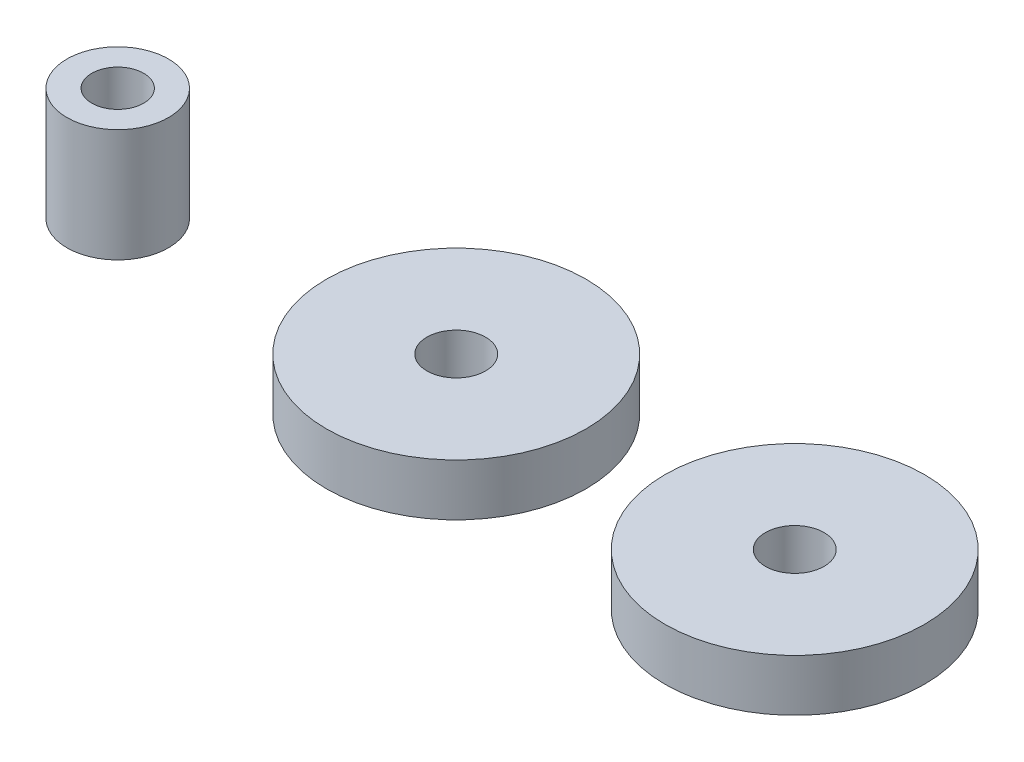
ISO-10303-21;
HEADER;
FILE_DESCRIPTION(('STEP AP214'),'2;1');
FILE_NAME('part.step','',(''),(''),'','','');
FILE_SCHEMA(('AUTOMOTIVE_DESIGN { 1 0 10303 214 1 1 1 1 }'));
ENDSEC;
DATA;
#1=APPLICATION_CONTEXT('core data for automotive mechanical design processes');
#2=APPLICATION_PROTOCOL_DEFINITION('international standard','automotive_design',2000,#1);
#3=PRODUCT_CONTEXT('',#1,'mechanical');
#4=PRODUCT('Part','Part','',(#3));
#5=PRODUCT_RELATED_PRODUCT_CATEGORY('part','',(#4));
#6=PRODUCT_DEFINITION_FORMATION('','',#4);
#7=PRODUCT_DEFINITION_CONTEXT('part definition',#1,'design');
#8=PRODUCT_DEFINITION('design','',#6,#7);
#9=PRODUCT_DEFINITION_SHAPE('','',#8);
#10=(LENGTH_UNIT() NAMED_UNIT(*) SI_UNIT(.MILLI.,.METRE.));
#11=(NAMED_UNIT(*) PLANE_ANGLE_UNIT() SI_UNIT($,.RADIAN.));
#12=(NAMED_UNIT(*) SI_UNIT($,.STERADIAN.) SOLID_ANGLE_UNIT());
#13=UNCERTAINTY_MEASURE_WITH_UNIT(LENGTH_MEASURE(1.E-05),#10,'distance_accuracy_value','');
#14=(GEOMETRIC_REPRESENTATION_CONTEXT(3) GLOBAL_UNCERTAINTY_ASSIGNED_CONTEXT((#13)) GLOBAL_UNIT_ASSIGNED_CONTEXT((#10,
#11,#12)) REPRESENTATION_CONTEXT('',''));
#15=CARTESIAN_POINT('',(0.,0.,0.));
#16=DIRECTION('',(0.,0.,1.));
#17=DIRECTION('',(1.,0.,0.));
#18=AXIS2_PLACEMENT_3D('',#15,#16,#17);
#19=CARTESIAN_POINT('',(30.,2.3,0.));
#20=DIRECTION('',(0.,1.,0.));
#21=DIRECTION('',(0.,0.,1.));
#22=AXIS2_PLACEMENT_3D('',#19,#20,#21);
#23=PLANE('',#22);
#24=CARTESIAN_POINT('',(30.,2.3,0.));
#25=DIRECTION('',(0.,1.,0.));
#26=DIRECTION('',(0.,0.,1.));
#27=AXIS2_PLACEMENT_3D('',#24,#25,#26);
#28=CIRCLE('',#27,5.75);
#29=CARTESIAN_POINT('',(30.,2.3,5.75));
#30=VERTEX_POINT('',#29);
#31=EDGE_CURVE('E11',#30,#30,#28,.T.);
#32=ORIENTED_EDGE('',*,*,#31,.T.);
#33=EDGE_LOOP('',(#32));
#34=FACE_BOUND('',#33,.T.);
#35=CARTESIAN_POINT('',(30.,2.3,0.));
#36=DIRECTION('',(0.,1.,0.));
#37=DIRECTION('',(0.,0.,1.));
#38=AXIS2_PLACEMENT_3D('',#35,#36,#37);
#39=CIRCLE('',#38,1.29999999999999);
#40=CARTESIAN_POINT('',(30.,2.3,1.29999999999999));
#41=VERTEX_POINT('',#40);
#42=EDGE_CURVE('E55',#41,#41,#39,.T.);
#43=ORIENTED_EDGE('',*,*,#42,.F.);
#44=EDGE_LOOP('',(#43));
#45=FACE_BOUND('',#44,.T.);
#46=ADVANCED_FACE('F44',(#34,#45),#23,.T.);
#47=CARTESIAN_POINT('',(30.,0.,0.));
#48=DIRECTION('',(0.,1.,0.));
#49=DIRECTION('',(0.,0.,1.));
#50=AXIS2_PLACEMENT_3D('',#47,#48,#49);
#51=PLANE('',#50);
#52=CARTESIAN_POINT('',(30.,0.,0.));
#53=DIRECTION('',(0.,1.,0.));
#54=DIRECTION('',(0.,0.,1.));
#55=AXIS2_PLACEMENT_3D('',#52,#53,#54);
#56=CIRCLE('',#55,5.75);
#57=CARTESIAN_POINT('',(30.,0.,5.75));
#58=VERTEX_POINT('',#57);
#59=EDGE_CURVE('E48',#58,#58,#56,.T.);
#60=ORIENTED_EDGE('',*,*,#59,.F.);
#61=EDGE_LOOP('',(#60));
#62=FACE_BOUND('',#61,.T.);
#63=CARTESIAN_POINT('',(30.,0.,0.));
#64=DIRECTION('',(0.,1.,0.));
#65=DIRECTION('',(0.,0.,1.));
#66=AXIS2_PLACEMENT_3D('',#63,#64,#65);
#67=CIRCLE('',#66,1.29999999999999);
#68=CARTESIAN_POINT('',(30.,0.,1.29999999999999));
#69=VERTEX_POINT('',#68);
#70=EDGE_CURVE('E57',#69,#69,#67,.T.);
#71=ORIENTED_EDGE('',*,*,#70,.T.);
#72=EDGE_LOOP('',(#71));
#73=FACE_BOUND('',#72,.T.);
#74=ADVANCED_FACE('F67',(#62,#73),#51,.F.);
#75=CARTESIAN_POINT('',(30.,2.3,0.));
#76=DIRECTION('',(0.,-1.,0.));
#77=DIRECTION('',(0.,0.,-1.));
#78=AXIS2_PLACEMENT_3D('',#75,#76,#77);
#79=CYLINDRICAL_SURFACE('',#78,5.75);
#80=ORIENTED_EDGE('',*,*,#31,.F.);
#81=EDGE_LOOP('',(#80));
#82=FACE_BOUND('',#81,.T.);
#83=ORIENTED_EDGE('',*,*,#59,.T.);
#84=EDGE_LOOP('',(#83));
#85=FACE_BOUND('',#84,.T.);
#86=ADVANCED_FACE('F46',(#82,#85),#79,.T.);
#87=CARTESIAN_POINT('',(30.,2.3,0.));
#88=DIRECTION('',(0.,-1.,0.));
#89=DIRECTION('',(0.,0.,-1.));
#90=AXIS2_PLACEMENT_3D('',#87,#88,#89);
#91=CYLINDRICAL_SURFACE('',#90,1.29999999999999);
#92=ORIENTED_EDGE('',*,*,#42,.T.);
#93=EDGE_LOOP('',(#92));
#94=FACE_BOUND('',#93,.T.);
#95=ORIENTED_EDGE('',*,*,#70,.F.);
#96=EDGE_LOOP('',(#95));
#97=FACE_BOUND('',#96,.T.);
#98=ADVANCED_FACE('F63',(#94,#97),#91,.F.);
#99=CLOSED_SHELL('',(#46,#74,#86,#98));
#100=MANIFOLD_SOLID_BREP('B2',#99);
#101=CARTESIAN_POINT('',(15.,2.3,0.));
#102=DIRECTION('',(0.,1.,0.));
#103=DIRECTION('',(0.,0.,1.));
#104=AXIS2_PLACEMENT_3D('',#101,#102,#103);
#105=PLANE('',#104);
#106=CARTESIAN_POINT('',(15.,2.3,0.));
#107=DIRECTION('',(0.,1.,0.));
#108=DIRECTION('',(0.,0.,1.));
#109=AXIS2_PLACEMENT_3D('',#106,#107,#108);
#110=CIRCLE('',#109,5.75);
#111=CARTESIAN_POINT('',(15.,2.3,5.75));
#112=VERTEX_POINT('',#111);
#113=EDGE_CURVE('E43',#112,#112,#110,.T.);
#114=ORIENTED_EDGE('',*,*,#113,.T.);
#115=EDGE_LOOP('',(#114));
#116=FACE_BOUND('',#115,.T.);
#117=CARTESIAN_POINT('',(15.,2.3,0.));
#118=DIRECTION('',(0.,1.,0.));
#119=DIRECTION('',(0.,0.,1.));
#120=AXIS2_PLACEMENT_3D('',#117,#118,#119);
#121=CIRCLE('',#120,1.3);
#122=CARTESIAN_POINT('',(15.,2.3,1.3));
#123=VERTEX_POINT('',#122);
#124=EDGE_CURVE('E124',#123,#123,#121,.T.);
#125=ORIENTED_EDGE('',*,*,#124,.F.);
#126=EDGE_LOOP('',(#125));
#127=FACE_BOUND('',#126,.T.);
#128=ADVANCED_FACE('F113',(#116,#127),#105,.T.);
#129=CARTESIAN_POINT('',(15.,0.,0.));
#130=DIRECTION('',(0.,1.,0.));
#131=DIRECTION('',(0.,0.,1.));
#132=AXIS2_PLACEMENT_3D('',#129,#130,#131);
#133=PLANE('',#132);
#134=CARTESIAN_POINT('',(15.,0.,0.));
#135=DIRECTION('',(0.,1.,0.));
#136=DIRECTION('',(0.,0.,1.));
#137=AXIS2_PLACEMENT_3D('',#134,#135,#136);
#138=CIRCLE('',#137,5.75);
#139=CARTESIAN_POINT('',(15.,0.,5.75));
#140=VERTEX_POINT('',#139);
#141=EDGE_CURVE('E117',#140,#140,#138,.T.);
#142=ORIENTED_EDGE('',*,*,#141,.F.);
#143=EDGE_LOOP('',(#142));
#144=FACE_BOUND('',#143,.T.);
#145=CARTESIAN_POINT('',(15.,0.,0.));
#146=DIRECTION('',(0.,1.,0.));
#147=DIRECTION('',(0.,0.,1.));
#148=AXIS2_PLACEMENT_3D('',#145,#146,#147);
#149=CIRCLE('',#148,1.3);
#150=CARTESIAN_POINT('',(15.,0.,1.3));
#151=VERTEX_POINT('',#150);
#152=EDGE_CURVE('E126',#151,#151,#149,.T.);
#153=ORIENTED_EDGE('',*,*,#152,.T.);
#154=EDGE_LOOP('',(#153));
#155=FACE_BOUND('',#154,.T.);
#156=ADVANCED_FACE('F136',(#144,#155),#133,.F.);
#157=CARTESIAN_POINT('',(15.,2.3,0.));
#158=DIRECTION('',(0.,-1.,0.));
#159=DIRECTION('',(0.,0.,-1.));
#160=AXIS2_PLACEMENT_3D('',#157,#158,#159);
#161=CYLINDRICAL_SURFACE('',#160,5.75);
#162=ORIENTED_EDGE('',*,*,#113,.F.);
#163=EDGE_LOOP('',(#162));
#164=FACE_BOUND('',#163,.T.);
#165=ORIENTED_EDGE('',*,*,#141,.T.);
#166=EDGE_LOOP('',(#165));
#167=FACE_BOUND('',#166,.T.);
#168=ADVANCED_FACE('F115',(#164,#167),#161,.T.);
#169=CARTESIAN_POINT('',(15.,2.3,0.));
#170=DIRECTION('',(0.,-1.,0.));
#171=DIRECTION('',(0.,0.,-1.));
#172=AXIS2_PLACEMENT_3D('',#169,#170,#171);
#173=CYLINDRICAL_SURFACE('',#172,1.3);
#174=ORIENTED_EDGE('',*,*,#124,.T.);
#175=EDGE_LOOP('',(#174));
#176=FACE_BOUND('',#175,.T.);
#177=ORIENTED_EDGE('',*,*,#152,.F.);
#178=EDGE_LOOP('',(#177));
#179=FACE_BOUND('',#178,.T.);
#180=ADVANCED_FACE('F132',(#176,#179),#173,.F.);
#181=CLOSED_SHELL('',(#128,#156,#168,#180));
#182=MANIFOLD_SOLID_BREP('B6',#181);
#183=CARTESIAN_POINT('',(0.,5.,0.));
#184=DIRECTION('',(0.,1.,0.));
#185=DIRECTION('',(0.,0.,1.));
#186=AXIS2_PLACEMENT_3D('',#183,#184,#185);
#187=PLANE('',#186);
#188=CARTESIAN_POINT('',(0.,5.,0.));
#189=DIRECTION('',(0.,1.,0.));
#190=DIRECTION('',(0.,0.,1.));
#191=AXIS2_PLACEMENT_3D('',#188,#189,#190);
#192=CIRCLE('',#191,2.25);
#193=CARTESIAN_POINT('',(0.,5.,2.25));
#194=VERTEX_POINT('',#193);
#195=EDGE_CURVE('E112',#194,#194,#192,.T.);
#196=ORIENTED_EDGE('',*,*,#195,.T.);
#197=EDGE_LOOP('',(#196));
#198=FACE_BOUND('',#197,.T.);
#199=CARTESIAN_POINT('',(0.,5.,0.));
#200=DIRECTION('',(0.,1.,0.));
#201=DIRECTION('',(0.,0.,1.));
#202=AXIS2_PLACEMENT_3D('',#199,#200,#201);
#203=CIRCLE('',#202,1.15);
#204=CARTESIAN_POINT('',(0.,5.,1.15));
#205=VERTEX_POINT('',#204);
#206=EDGE_CURVE('E186',#205,#205,#203,.T.);
#207=ORIENTED_EDGE('',*,*,#206,.F.);
#208=EDGE_LOOP('',(#207));
#209=FACE_BOUND('',#208,.T.);
#210=ADVANCED_FACE('F175',(#198,#209),#187,.T.);
#211=CARTESIAN_POINT('',(0.,0.,0.));
#212=DIRECTION('',(0.,1.,0.));
#213=DIRECTION('',(0.,0.,1.));
#214=AXIS2_PLACEMENT_3D('',#211,#212,#213);
#215=PLANE('',#214);
#216=CARTESIAN_POINT('',(0.,0.,0.));
#217=DIRECTION('',(0.,1.,0.));
#218=DIRECTION('',(0.,0.,1.));
#219=AXIS2_PLACEMENT_3D('',#216,#217,#218);
#220=CIRCLE('',#219,2.25);
#221=CARTESIAN_POINT('',(0.,0.,2.25));
#222=VERTEX_POINT('',#221);
#223=EDGE_CURVE('E179',#222,#222,#220,.T.);
#224=ORIENTED_EDGE('',*,*,#223,.F.);
#225=EDGE_LOOP('',(#224));
#226=FACE_BOUND('',#225,.T.);
#227=CARTESIAN_POINT('',(0.,0.,0.));
#228=DIRECTION('',(0.,1.,0.));
#229=DIRECTION('',(0.,0.,1.));
#230=AXIS2_PLACEMENT_3D('',#227,#228,#229);
#231=CIRCLE('',#230,1.15);
#232=CARTESIAN_POINT('',(0.,0.,1.15));
#233=VERTEX_POINT('',#232);
#234=EDGE_CURVE('E188',#233,#233,#231,.T.);
#235=ORIENTED_EDGE('',*,*,#234,.T.);
#236=EDGE_LOOP('',(#235));
#237=FACE_BOUND('',#236,.T.);
#238=ADVANCED_FACE('F198',(#226,#237),#215,.F.);
#239=CARTESIAN_POINT('',(0.,5.,0.));
#240=DIRECTION('',(0.,-1.,0.));
#241=DIRECTION('',(0.,0.,-1.));
#242=AXIS2_PLACEMENT_3D('',#239,#240,#241);
#243=CYLINDRICAL_SURFACE('',#242,2.25);
#244=ORIENTED_EDGE('',*,*,#195,.F.);
#245=EDGE_LOOP('',(#244));
#246=FACE_BOUND('',#245,.T.);
#247=ORIENTED_EDGE('',*,*,#223,.T.);
#248=EDGE_LOOP('',(#247));
#249=FACE_BOUND('',#248,.T.);
#250=ADVANCED_FACE('F177',(#246,#249),#243,.T.);
#251=CARTESIAN_POINT('',(0.,5.,0.));
#252=DIRECTION('',(0.,-1.,0.));
#253=DIRECTION('',(0.,0.,-1.));
#254=AXIS2_PLACEMENT_3D('',#251,#252,#253);
#255=CYLINDRICAL_SURFACE('',#254,1.15);
#256=ORIENTED_EDGE('',*,*,#206,.T.);
#257=EDGE_LOOP('',(#256));
#258=FACE_BOUND('',#257,.T.);
#259=ORIENTED_EDGE('',*,*,#234,.F.);
#260=EDGE_LOOP('',(#259));
#261=FACE_BOUND('',#260,.T.);
#262=ADVANCED_FACE('F194',(#258,#261),#255,.F.);
#263=CLOSED_SHELL('',(#210,#238,#250,#262));
#264=MANIFOLD_SOLID_BREP('B38',#263);
#265=ADVANCED_BREP_SHAPE_REPRESENTATION('',(#18,#100,#182,#264),#14);
#266=SHAPE_DEFINITION_REPRESENTATION(#9,#265);
ENDSEC;
END-ISO-10303-21;
